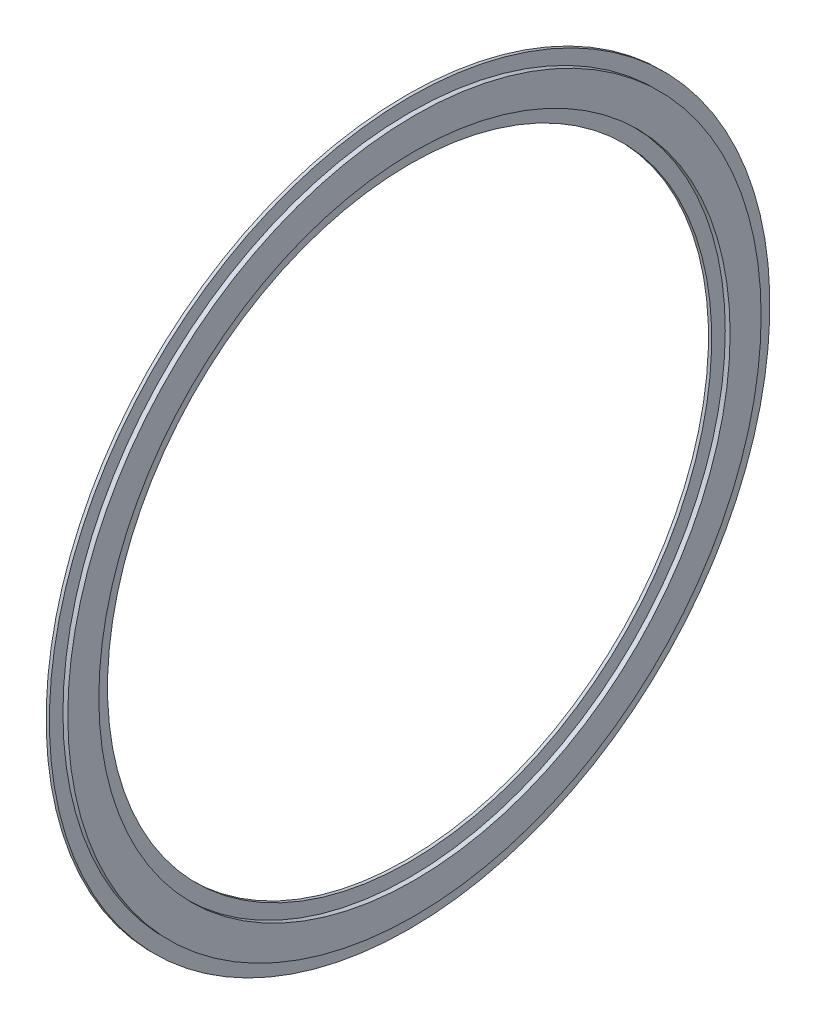
ISO-10303-21;
HEADER;
FILE_DESCRIPTION(('STEP AP214'),'2;1');
FILE_NAME('part.step','',(''),(''),'','','');
FILE_SCHEMA(('AUTOMOTIVE_DESIGN { 1 0 10303 214 1 1 1 1 }'));
ENDSEC;
DATA;
#1=APPLICATION_CONTEXT('core data for automotive mechanical design processes');
#2=APPLICATION_PROTOCOL_DEFINITION('international standard','automotive_design',2000,#1);
#3=PRODUCT_CONTEXT('',#1,'mechanical');
#4=PRODUCT('Part','Part','',(#3));
#5=PRODUCT_RELATED_PRODUCT_CATEGORY('part','',(#4));
#6=PRODUCT_DEFINITION_FORMATION('','',#4);
#7=PRODUCT_DEFINITION_CONTEXT('part definition',#1,'design');
#8=PRODUCT_DEFINITION('design','',#6,#7);
#9=PRODUCT_DEFINITION_SHAPE('','',#8);
#10=(LENGTH_UNIT() NAMED_UNIT(*) SI_UNIT(.MILLI.,.METRE.));
#11=(NAMED_UNIT(*) PLANE_ANGLE_UNIT() SI_UNIT($,.RADIAN.));
#12=(NAMED_UNIT(*) SI_UNIT($,.STERADIAN.) SOLID_ANGLE_UNIT());
#13=UNCERTAINTY_MEASURE_WITH_UNIT(LENGTH_MEASURE(1.E-05),#10,'distance_accuracy_value','');
#14=(GEOMETRIC_REPRESENTATION_CONTEXT(3) GLOBAL_UNCERTAINTY_ASSIGNED_CONTEXT((#13)) GLOBAL_UNIT_ASSIGNED_CONTEXT((#10,
#11,#12)) REPRESENTATION_CONTEXT('',''));
#15=CARTESIAN_POINT('',(0.,0.,0.));
#16=DIRECTION('',(0.,0.,1.));
#17=DIRECTION('',(1.,0.,0.));
#18=AXIS2_PLACEMENT_3D('',#15,#16,#17);
#19=CARTESIAN_POINT('',(3.,21.78,0.));
#20=DIRECTION('',(-1.,0.,0.));
#21=DIRECTION('',(0.,1.,0.));
#22=AXIS2_PLACEMENT_3D('',#19,#20,#21);
#23=PLANE('',#22);
#24=CARTESIAN_POINT('',(3.,0.,0.));
#25=DIRECTION('',(-1.,0.,0.));
#26=DIRECTION('',(0.,1.,0.));
#27=AXIS2_PLACEMENT_3D('',#24,#25,#26);
#28=CIRCLE('',#27,22.3);
#29=CARTESIAN_POINT('',(3.,22.3,0.));
#30=VERTEX_POINT('',#29);
#31=EDGE_CURVE('E10',#30,#30,#28,.T.);
#32=ORIENTED_EDGE('',*,*,#31,.T.);
#33=EDGE_LOOP('',(#32));
#34=FACE_BOUND('',#33,.T.);
#35=CARTESIAN_POINT('',(3.,0.,0.));
#36=DIRECTION('',(-1.,0.,0.));
#37=DIRECTION('',(0.,1.,0.));
#38=AXIS2_PLACEMENT_3D('',#35,#36,#37);
#39=CIRCLE('',#38,21.26);
#40=CARTESIAN_POINT('',(3.,21.26,0.));
#41=VERTEX_POINT('',#40);
#42=EDGE_CURVE('E74',#41,#41,#39,.T.);
#43=ORIENTED_EDGE('',*,*,#42,.F.);
#44=EDGE_LOOP('',(#43));
#45=FACE_BOUND('',#44,.T.);
#46=ADVANCED_FACE('F15',(#34,#45),#23,.T.);
#47=CARTESIAN_POINT('',(3.1,0.,0.));
#48=DIRECTION('',(1.,0.,0.));
#49=DIRECTION('',(0.,1.,0.));
#50=AXIS2_PLACEMENT_3D('',#47,#48,#49);
#51=CYLINDRICAL_SURFACE('',#50,22.3);
#52=CARTESIAN_POINT('',(3.2,0.,0.));
#53=DIRECTION('',(-1.,0.,0.));
#54=DIRECTION('',(0.,1.,0.));
#55=AXIS2_PLACEMENT_3D('',#52,#53,#54);
#56=CIRCLE('',#55,22.3);
#57=CARTESIAN_POINT('',(3.2,22.3,0.));
#58=VERTEX_POINT('',#57);
#59=EDGE_CURVE('E25',#58,#58,#56,.T.);
#60=ORIENTED_EDGE('',*,*,#59,.T.);
#61=EDGE_LOOP('',(#60));
#62=FACE_BOUND('',#61,.T.);
#63=ORIENTED_EDGE('',*,*,#31,.F.);
#64=EDGE_LOOP('',(#63));
#65=FACE_BOUND('',#64,.T.);
#66=ADVANCED_FACE('F91',(#62,#65),#51,.T.);
#67=CARTESIAN_POINT('',(3.2,21.88,0.));
#68=DIRECTION('',(1.,0.,0.));
#69=DIRECTION('',(0.,-1.,0.));
#70=AXIS2_PLACEMENT_3D('',#67,#68,#69);
#71=PLANE('',#70);
#72=CARTESIAN_POINT('',(3.2,0.,0.));
#73=DIRECTION('',(-1.,0.,0.));
#74=DIRECTION('',(0.,1.,0.));
#75=AXIS2_PLACEMENT_3D('',#72,#73,#74);
#76=CIRCLE('',#75,21.46);
#77=CARTESIAN_POINT('',(3.2,21.46,0.));
#78=VERTEX_POINT('',#77);
#79=EDGE_CURVE('E65',#78,#78,#76,.T.);
#80=ORIENTED_EDGE('',*,*,#79,.T.);
#81=EDGE_LOOP('',(#80));
#82=FACE_BOUND('',#81,.T.);
#83=ORIENTED_EDGE('',*,*,#59,.F.);
#84=EDGE_LOOP('',(#83));
#85=FACE_BOUND('',#84,.T.);
#86=ADVANCED_FACE('F17',(#82,#85),#71,.T.);
#87=CARTESIAN_POINT('',(3.35,0.,0.));
#88=DIRECTION('',(1.,0.,0.));
#89=DIRECTION('',(0.,1.,0.));
#90=AXIS2_PLACEMENT_3D('',#87,#88,#89);
#91=CYLINDRICAL_SURFACE('',#90,21.46);
#92=CARTESIAN_POINT('',(3.5,0.,0.));
#93=DIRECTION('',(-1.,0.,0.));
#94=DIRECTION('',(0.,1.,0.));
#95=AXIS2_PLACEMENT_3D('',#92,#93,#94);
#96=CIRCLE('',#95,21.46);
#97=CARTESIAN_POINT('',(3.5,21.46,0.));
#98=VERTEX_POINT('',#97);
#99=EDGE_CURVE('E61',#98,#98,#96,.T.);
#100=ORIENTED_EDGE('',*,*,#99,.T.);
#101=EDGE_LOOP('',(#100));
#102=FACE_BOUND('',#101,.T.);
#103=ORIENTED_EDGE('',*,*,#79,.F.);
#104=EDGE_LOOP('',(#103));
#105=FACE_BOUND('',#104,.T.);
#106=ADVANCED_FACE('F101',(#102,#105),#91,.T.);
#107=CARTESIAN_POINT('',(3.5,20.5,0.));
#108=DIRECTION('',(1.,0.,0.));
#109=DIRECTION('',(0.,-1.,0.));
#110=AXIS2_PLACEMENT_3D('',#107,#108,#109);
#111=PLANE('',#110);
#112=CARTESIAN_POINT('',(3.5,0.,0.));
#113=DIRECTION('',(-1.,0.,0.));
#114=DIRECTION('',(0.,1.,0.));
#115=AXIS2_PLACEMENT_3D('',#112,#113,#114);
#116=CIRCLE('',#115,19.54);
#117=CARTESIAN_POINT('',(3.5,19.54,0.));
#118=VERTEX_POINT('',#117);
#119=EDGE_CURVE('E57',#118,#118,#116,.T.);
#120=ORIENTED_EDGE('',*,*,#119,.T.);
#121=EDGE_LOOP('',(#120));
#122=FACE_BOUND('',#121,.T.);
#123=ORIENTED_EDGE('',*,*,#99,.F.);
#124=EDGE_LOOP('',(#123));
#125=FACE_BOUND('',#124,.T.);
#126=ADVANCED_FACE('F104',(#122,#125),#111,.T.);
#127=CARTESIAN_POINT('',(3.35,0.,0.));
#128=DIRECTION('',(1.,0.,0.));
#129=DIRECTION('',(0.,1.,0.));
#130=AXIS2_PLACEMENT_3D('',#127,#128,#129);
#131=CYLINDRICAL_SURFACE('',#130,19.54);
#132=CARTESIAN_POINT('',(3.2,0.,0.));
#133=DIRECTION('',(-1.,0.,0.));
#134=DIRECTION('',(0.,1.,0.));
#135=AXIS2_PLACEMENT_3D('',#132,#133,#134);
#136=CIRCLE('',#135,19.54);
#137=CARTESIAN_POINT('',(3.2,19.54,0.));
#138=VERTEX_POINT('',#137);
#139=EDGE_CURVE('E76',#138,#138,#136,.T.);
#140=ORIENTED_EDGE('',*,*,#139,.T.);
#141=EDGE_LOOP('',(#140));
#142=FACE_BOUND('',#141,.T.);
#143=ORIENTED_EDGE('',*,*,#119,.F.);
#144=EDGE_LOOP('',(#143));
#145=FACE_BOUND('',#144,.T.);
#146=ADVANCED_FACE('F105',(#142,#145),#131,.F.);
#147=CARTESIAN_POINT('',(3.2,19.12,0.));
#148=DIRECTION('',(1.,0.,0.));
#149=DIRECTION('',(0.,-1.,0.));
#150=AXIS2_PLACEMENT_3D('',#147,#148,#149);
#151=PLANE('',#150);
#152=CARTESIAN_POINT('',(3.2,0.,0.));
#153=DIRECTION('',(-1.,0.,0.));
#154=DIRECTION('',(0.,1.,0.));
#155=AXIS2_PLACEMENT_3D('',#152,#153,#154);
#156=CIRCLE('',#155,18.7);
#157=CARTESIAN_POINT('',(3.2,18.7,0.));
#158=VERTEX_POINT('',#157);
#159=EDGE_CURVE('E77',#158,#158,#156,.T.);
#160=ORIENTED_EDGE('',*,*,#159,.T.);
#161=EDGE_LOOP('',(#160));
#162=FACE_BOUND('',#161,.T.);
#163=ORIENTED_EDGE('',*,*,#139,.F.);
#164=EDGE_LOOP('',(#163));
#165=FACE_BOUND('',#164,.T.);
#166=ADVANCED_FACE('F108',(#162,#165),#151,.T.);
#167=CARTESIAN_POINT('',(3.1,0.,0.));
#168=DIRECTION('',(1.,0.,0.));
#169=DIRECTION('',(0.,1.,0.));
#170=AXIS2_PLACEMENT_3D('',#167,#168,#169);
#171=CYLINDRICAL_SURFACE('',#170,18.7);
#172=CARTESIAN_POINT('',(3.,0.,0.));
#173=DIRECTION('',(-1.,0.,0.));
#174=DIRECTION('',(0.,1.,0.));
#175=AXIS2_PLACEMENT_3D('',#172,#173,#174);
#176=CIRCLE('',#175,18.7);
#177=CARTESIAN_POINT('',(3.,18.7,0.));
#178=VERTEX_POINT('',#177);
#179=EDGE_CURVE('E19',#178,#178,#176,.T.);
#180=ORIENTED_EDGE('',*,*,#179,.T.);
#181=EDGE_LOOP('',(#180));
#182=FACE_BOUND('',#181,.T.);
#183=ORIENTED_EDGE('',*,*,#159,.F.);
#184=EDGE_LOOP('',(#183));
#185=FACE_BOUND('',#184,.T.);
#186=ADVANCED_FACE('F117',(#182,#185),#171,.F.);
#187=CARTESIAN_POINT('',(3.,19.22,0.));
#188=DIRECTION('',(-1.,0.,0.));
#189=DIRECTION('',(0.,1.,0.));
#190=AXIS2_PLACEMENT_3D('',#187,#188,#189);
#191=PLANE('',#190);
#192=CARTESIAN_POINT('',(3.,0.,0.));
#193=DIRECTION('',(-1.,0.,0.));
#194=DIRECTION('',(0.,1.,0.));
#195=AXIS2_PLACEMENT_3D('',#192,#193,#194);
#196=CIRCLE('',#195,19.74);
#197=CARTESIAN_POINT('',(3.,19.74,0.));
#198=VERTEX_POINT('',#197);
#199=EDGE_CURVE('E81',#198,#198,#196,.T.);
#200=ORIENTED_EDGE('',*,*,#199,.T.);
#201=EDGE_LOOP('',(#200));
#202=FACE_BOUND('',#201,.T.);
#203=ORIENTED_EDGE('',*,*,#179,.F.);
#204=EDGE_LOOP('',(#203));
#205=FACE_BOUND('',#204,.T.);
#206=ADVANCED_FACE('F119',(#202,#205),#191,.T.);
#207=CARTESIAN_POINT('',(3.15,0.,0.));
#208=DIRECTION('',(1.,0.,0.));
#209=DIRECTION('',(0.,1.,0.));
#210=AXIS2_PLACEMENT_3D('',#207,#208,#209);
#211=CYLINDRICAL_SURFACE('',#210,19.74);
#212=CARTESIAN_POINT('',(3.3,0.,0.));
#213=DIRECTION('',(-1.,0.,0.));
#214=DIRECTION('',(0.,1.,0.));
#215=AXIS2_PLACEMENT_3D('',#212,#213,#214);
#216=CIRCLE('',#215,19.74);
#217=CARTESIAN_POINT('',(3.3,19.74,0.));
#218=VERTEX_POINT('',#217);
#219=EDGE_CURVE('E79',#218,#218,#216,.T.);
#220=ORIENTED_EDGE('',*,*,#219,.T.);
#221=EDGE_LOOP('',(#220));
#222=FACE_BOUND('',#221,.T.);
#223=ORIENTED_EDGE('',*,*,#199,.F.);
#224=EDGE_LOOP('',(#223));
#225=FACE_BOUND('',#224,.T.);
#226=ADVANCED_FACE('F113',(#222,#225),#211,.T.);
#227=CARTESIAN_POINT('',(3.3,20.5,0.));
#228=DIRECTION('',(-1.,0.,0.));
#229=DIRECTION('',(0.,1.,0.));
#230=AXIS2_PLACEMENT_3D('',#227,#228,#229);
#231=PLANE('',#230);
#232=CARTESIAN_POINT('',(3.3,0.,0.));
#233=DIRECTION('',(-1.,0.,0.));
#234=DIRECTION('',(0.,1.,0.));
#235=AXIS2_PLACEMENT_3D('',#232,#233,#234);
#236=CIRCLE('',#235,21.26);
#237=CARTESIAN_POINT('',(3.3,21.26,0.));
#238=VERTEX_POINT('',#237);
#239=EDGE_CURVE('E72',#238,#238,#236,.T.);
#240=ORIENTED_EDGE('',*,*,#239,.T.);
#241=EDGE_LOOP('',(#240));
#242=FACE_BOUND('',#241,.T.);
#243=ORIENTED_EDGE('',*,*,#219,.F.);
#244=EDGE_LOOP('',(#243));
#245=FACE_BOUND('',#244,.T.);
#246=ADVANCED_FACE('F110',(#242,#245),#231,.T.);
#247=CARTESIAN_POINT('',(3.15,0.,0.));
#248=DIRECTION('',(1.,0.,0.));
#249=DIRECTION('',(0.,1.,0.));
#250=AXIS2_PLACEMENT_3D('',#247,#248,#249);
#251=CYLINDRICAL_SURFACE('',#250,21.26);
#252=ORIENTED_EDGE('',*,*,#42,.T.);
#253=EDGE_LOOP('',(#252));
#254=FACE_BOUND('',#253,.T.);
#255=ORIENTED_EDGE('',*,*,#239,.F.);
#256=EDGE_LOOP('',(#255));
#257=FACE_BOUND('',#256,.T.);
#258=ADVANCED_FACE('F87',(#254,#257),#251,.F.);
#259=CLOSED_SHELL('',(#46,#66,#86,#106,#126,#146,#166,#186,#206,#226,#246,#258));
#260=MANIFOLD_SOLID_BREP('B1',#259);
#261=ADVANCED_BREP_SHAPE_REPRESENTATION('',(#18,#260),#14);
#262=SHAPE_DEFINITION_REPRESENTATION(#9,#261);
ENDSEC;
END-ISO-10303-21;
